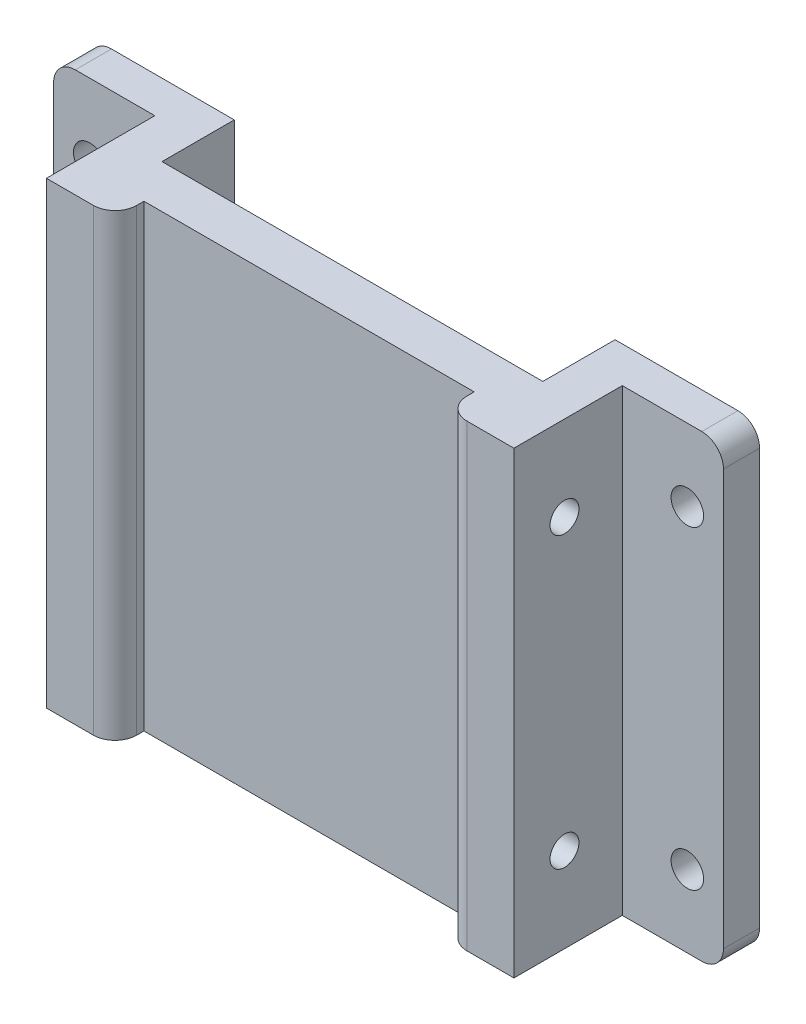
ISO-10303-21;
HEADER;
FILE_DESCRIPTION(('STEP AP214'),'2;1');
FILE_NAME('part.step','',(''),(''),'','','');
FILE_SCHEMA(('AUTOMOTIVE_DESIGN { 1 0 10303 214 1 1 1 1 }'));
ENDSEC;
DATA;
#1=APPLICATION_CONTEXT('core data for automotive mechanical design processes');
#2=APPLICATION_PROTOCOL_DEFINITION('international standard','automotive_design',2000,#1);
#3=PRODUCT_CONTEXT('',#1,'mechanical');
#4=PRODUCT('Part','Part','',(#3));
#5=PRODUCT_RELATED_PRODUCT_CATEGORY('part','',(#4));
#6=PRODUCT_DEFINITION_FORMATION('','',#4);
#7=PRODUCT_DEFINITION_CONTEXT('part definition',#1,'design');
#8=PRODUCT_DEFINITION('design','',#6,#7);
#9=PRODUCT_DEFINITION_SHAPE('','',#8);
#10=(LENGTH_UNIT() NAMED_UNIT(*) SI_UNIT(.MILLI.,.METRE.));
#11=(NAMED_UNIT(*) PLANE_ANGLE_UNIT() SI_UNIT($,.RADIAN.));
#12=(NAMED_UNIT(*) SI_UNIT($,.STERADIAN.) SOLID_ANGLE_UNIT());
#13=UNCERTAINTY_MEASURE_WITH_UNIT(LENGTH_MEASURE(1.E-05),#10,'distance_accuracy_value','');
#14=(GEOMETRIC_REPRESENTATION_CONTEXT(3) GLOBAL_UNCERTAINTY_ASSIGNED_CONTEXT((#13)) GLOBAL_UNIT_ASSIGNED_CONTEXT((#10,
#11,#12)) REPRESENTATION_CONTEXT('',''));
#15=CARTESIAN_POINT('',(0.,0.,0.));
#16=DIRECTION('',(0.,0.,1.));
#17=DIRECTION('',(1.,0.,0.));
#18=AXIS2_PLACEMENT_3D('',#15,#16,#17);
#19=CARTESIAN_POINT('',(-26.35,31.7500000000008,5.));
#20=DIRECTION('',(-1.,0.,0.));
#21=DIRECTION('',(0.,-1.,0.));
#22=AXIS2_PLACEMENT_3D('',#19,#20,#21);
#23=PLANE('',#22);
#24=DIRECTION('',(0.,1.,0.));
#25=VECTOR('',#24,1.);
#26=CARTESIAN_POINT('',(-26.35,-31.7500000000008,10.));
#27=LINE('',#26,#25);
#28=CARTESIAN_POINT('',(-26.35,-31.7500000000008,10.));
#29=VERTEX_POINT('',#28);
#30=CARTESIAN_POINT('',(-26.35,31.7500000000008,10.));
#31=VERTEX_POINT('',#30);
#32=EDGE_CURVE('E210',#29,#31,#27,.T.);
#33=ORIENTED_EDGE('',*,*,#32,.F.);
#34=DIRECTION('',(0.,0.,-1.));
#35=VECTOR('',#34,1.);
#36=CARTESIAN_POINT('',(-26.35,-31.7500000000008,5.));
#37=LINE('',#36,#35);
#38=CARTESIAN_POINT('',(-26.35,-31.7500000000008,0.));
#39=VERTEX_POINT('',#38);
#40=EDGE_CURVE('E260',#29,#39,#37,.T.);
#41=ORIENTED_EDGE('',*,*,#40,.T.);
#42=DIRECTION('',(0.,1.,0.));
#43=VECTOR('',#42,1.);
#44=CARTESIAN_POINT('',(-26.35,31.7500000000008,0.));
#45=LINE('',#44,#43);
#46=CARTESIAN_POINT('',(-26.35,31.7500000000008,0.));
#47=VERTEX_POINT('',#46);
#48=EDGE_CURVE('E254',#39,#47,#45,.T.);
#49=ORIENTED_EDGE('',*,*,#48,.T.);
#50=DIRECTION('',(0.,0.,-1.));
#51=VECTOR('',#50,1.);
#52=CARTESIAN_POINT('',(-26.35,31.7500000000008,5.));
#53=LINE('',#52,#51);
#54=EDGE_CURVE('E250',#31,#47,#53,.T.);
#55=ORIENTED_EDGE('',*,*,#54,.F.);
#56=EDGE_LOOP('',(#33,#41,#49,#55));
#57=FACE_BOUND('',#56,.T.);
#58=ADVANCED_FACE('F33',(#57),#23,.F.);
#59=CARTESIAN_POINT('',(-46.35,31.7500000000008,5.));
#60=DIRECTION('',(1.,0.,0.));
#61=DIRECTION('',(0.,1.,0.));
#62=AXIS2_PLACEMENT_3D('',#59,#60,#61);
#63=PLANE('',#62);
#64=DIRECTION('',(0.,-1.,0.));
#65=VECTOR('',#64,1.);
#66=CARTESIAN_POINT('',(-46.35,31.7500000000008,0.));
#67=LINE('',#66,#65);
#68=CARTESIAN_POINT('',(-46.35,28.7500000000008,0.));
#69=VERTEX_POINT('',#68);
#70=CARTESIAN_POINT('',(-46.35,-28.7500000000008,0.));
#71=VERTEX_POINT('',#70);
#72=EDGE_CURVE('E242',#69,#71,#67,.T.);
#73=ORIENTED_EDGE('',*,*,#72,.T.);
#74=DIRECTION('',(0.,0.,-1.));
#75=VECTOR('',#74,1.);
#76=CARTESIAN_POINT('',(-46.35,-28.7500000000008,5.));
#77=LINE('',#76,#75);
#78=CARTESIAN_POINT('',(-46.35,-28.7500000000008,5.));
#79=VERTEX_POINT('',#78);
#80=EDGE_CURVE('E48',#71,#79,#77,.F.);
#81=ORIENTED_EDGE('',*,*,#80,.T.);
#82=DIRECTION('',(0.,-1.,0.));
#83=VECTOR('',#82,1.);
#84=CARTESIAN_POINT('',(-46.35,31.7500000000008,5.));
#85=LINE('',#84,#83);
#86=CARTESIAN_POINT('',(-46.35,28.7500000000008,5.));
#87=VERTEX_POINT('',#86);
#88=EDGE_CURVE('E243',#87,#79,#85,.T.);
#89=ORIENTED_EDGE('',*,*,#88,.F.);
#90=DIRECTION('',(0.,0.,-1.));
#91=VECTOR('',#90,1.);
#92=CARTESIAN_POINT('',(-46.35,28.7500000000008,5.));
#93=LINE('',#92,#91);
#94=EDGE_CURVE('E307',#87,#69,#93,.T.);
#95=ORIENTED_EDGE('',*,*,#94,.T.);
#96=EDGE_LOOP('',(#73,#81,#89,#95));
#97=FACE_BOUND('',#96,.T.);
#98=ADVANCED_FACE('F312',(#97),#63,.F.);
#99=CARTESIAN_POINT('',(-46.35,-31.7500000000008,5.));
#100=DIRECTION('',(0.,1.,0.));
#101=DIRECTION('',(0.,0.,1.));
#102=AXIS2_PLACEMENT_3D('',#99,#100,#101);
#103=PLANE('',#102);
#104=DIRECTION('',(0.,0.,-1.));
#105=VECTOR('',#104,1.);
#106=CARTESIAN_POINT('',(-22.85,-31.7500000000008,20.));
#107=LINE('',#106,#105);
#108=CARTESIAN_POINT('',(-22.85,-31.7500000000008,17.));
#109=VERTEX_POINT('',#108);
#110=CARTESIAN_POINT('',(-22.8500000000054,-31.7500000000008,16.));
#111=VERTEX_POINT('',#110);
#112=EDGE_CURVE('E478',#109,#111,#107,.T.);
#113=ORIENTED_EDGE('',*,*,#112,.F.);
#114=CARTESIAN_POINT('',(-25.85,-31.7500000000008,17.));
#115=DIRECTION('',(0.,1.,0.));
#116=DIRECTION('',(0.,0.,1.));
#117=AXIS2_PLACEMENT_3D('',#114,#115,#116);
#118=CIRCLE('',#117,3.);
#119=CARTESIAN_POINT('',(-25.85,-31.7500000000008,20.));
#120=VERTEX_POINT('',#119);
#121=EDGE_CURVE('E273',#109,#120,#118,.F.);
#122=ORIENTED_EDGE('',*,*,#121,.T.);
#123=DIRECTION('',(1.,0.,0.));
#124=VECTOR('',#123,1.);
#125=CARTESIAN_POINT('',(-26.35,-31.7500000000008,20.));
#126=LINE('',#125,#124);
#127=CARTESIAN_POINT('',(-32.35,-31.7500000000008,20.));
#128=VERTEX_POINT('',#127);
#129=EDGE_CURVE('E231',#128,#120,#126,.T.);
#130=ORIENTED_EDGE('',*,*,#129,.F.);
#131=DIRECTION('',(0.,0.,-1.));
#132=VECTOR('',#131,1.);
#133=CARTESIAN_POINT('',(-32.35,-31.7500000000008,20.));
#134=LINE('',#133,#132);
#135=CARTESIAN_POINT('',(-32.35,-31.7500000000008,5.));
#136=VERTEX_POINT('',#135);
#137=EDGE_CURVE('E234',#128,#136,#134,.T.);
#138=ORIENTED_EDGE('',*,*,#137,.T.);
#139=DIRECTION('',(1.,0.,0.));
#140=VECTOR('',#139,1.);
#141=CARTESIAN_POINT('',(-46.35,-31.7500000000008,5.));
#142=LINE('',#141,#140);
#143=CARTESIAN_POINT('',(-43.35,-31.7500000000008,5.));
#144=VERTEX_POINT('',#143);
#145=EDGE_CURVE('E245',#144,#136,#142,.T.);
#146=ORIENTED_EDGE('',*,*,#145,.F.);
#147=DIRECTION('',(0.,0.,-1.));
#148=VECTOR('',#147,1.);
#149=CARTESIAN_POINT('',(-43.35,-31.7500000000008,5.));
#150=LINE('',#149,#148);
#151=CARTESIAN_POINT('',(-43.35,-31.7500000000008,0.));
#152=VERTEX_POINT('',#151);
#153=EDGE_CURVE('E266',#144,#152,#150,.T.);
#154=ORIENTED_EDGE('',*,*,#153,.T.);
#155=DIRECTION('',(1.,0.,0.));
#156=VECTOR('',#155,1.);
#157=CARTESIAN_POINT('',(-46.35,-31.7500000000008,0.));
#158=LINE('',#157,#156);
#159=EDGE_CURVE('E252',#152,#39,#158,.T.);
#160=ORIENTED_EDGE('',*,*,#159,.T.);
#161=ORIENTED_EDGE('',*,*,#40,.F.);
#162=DIRECTION('',(-1.,0.,0.));
#163=VECTOR('',#162,1.);
#164=CARTESIAN_POINT('',(500000.,-31.7500000000008,10.));
#165=LINE('',#164,#163);
#166=CARTESIAN_POINT('',(26.3499999999794,-31.7500000000008,10.));
#167=VERTEX_POINT('',#166);
#168=EDGE_CURVE('E213',#167,#29,#165,.T.);
#169=ORIENTED_EDGE('',*,*,#168,.F.);
#170=DIRECTION('',(0.,0.,-1.));
#171=VECTOR('',#170,1.);
#172=CARTESIAN_POINT('',(26.35,-31.7500000000008,5.));
#173=LINE('',#172,#171);
#174=CARTESIAN_POINT('',(26.35,-31.7500000000008,0.));
#175=VERTEX_POINT('',#174);
#176=EDGE_CURVE('E406',#167,#175,#173,.T.);
#177=ORIENTED_EDGE('',*,*,#176,.T.);
#178=DIRECTION('',(1.,0.,0.));
#179=VECTOR('',#178,1.);
#180=CARTESIAN_POINT('',(46.35,-31.7500000000008,0.));
#181=LINE('',#180,#179);
#182=CARTESIAN_POINT('',(43.35,-31.7500000000008,0.));
#183=VERTEX_POINT('',#182);
#184=EDGE_CURVE('E399',#175,#183,#181,.T.);
#185=ORIENTED_EDGE('',*,*,#184,.T.);
#186=DIRECTION('',(0.,0.,-1.));
#187=VECTOR('',#186,1.);
#188=CARTESIAN_POINT('',(43.35,-31.7500000000008,5.));
#189=LINE('',#188,#187);
#190=CARTESIAN_POINT('',(43.35,-31.7500000000008,5.));
#191=VERTEX_POINT('',#190);
#192=EDGE_CURVE('E269',#183,#191,#189,.F.);
#193=ORIENTED_EDGE('',*,*,#192,.T.);
#194=DIRECTION('',(1.,0.,0.));
#195=VECTOR('',#194,1.);
#196=CARTESIAN_POINT('',(46.35,-31.7500000000008,5.));
#197=LINE('',#196,#195);
#198=CARTESIAN_POINT('',(32.35,-31.7500000000008,5.));
#199=VERTEX_POINT('',#198);
#200=EDGE_CURVE('E394',#199,#191,#197,.T.);
#201=ORIENTED_EDGE('',*,*,#200,.F.);
#202=DIRECTION('',(0.,0.,-1.));
#203=VECTOR('',#202,1.);
#204=CARTESIAN_POINT('',(32.35,-31.7500000000008,20.));
#205=LINE('',#204,#203);
#206=CARTESIAN_POINT('',(32.35,-31.7500000000008,20.));
#207=VERTEX_POINT('',#206);
#208=EDGE_CURVE('E402',#207,#199,#205,.T.);
#209=ORIENTED_EDGE('',*,*,#208,.F.);
#210=DIRECTION('',(1.,0.,0.));
#211=VECTOR('',#210,1.);
#212=CARTESIAN_POINT('',(26.35,-31.7500000000008,20.));
#213=LINE('',#212,#211);
#214=CARTESIAN_POINT('',(25.85,-31.7500000000008,20.));
#215=VERTEX_POINT('',#214);
#216=EDGE_CURVE('E487',#215,#207,#213,.T.);
#217=ORIENTED_EDGE('',*,*,#216,.F.);
#218=CARTESIAN_POINT('',(25.85,-31.7500000000008,17.));
#219=DIRECTION('',(0.,1.,0.));
#220=DIRECTION('',(0.,0.,1.));
#221=AXIS2_PLACEMENT_3D('',#218,#219,#220);
#222=CIRCLE('',#221,3.);
#223=CARTESIAN_POINT('',(22.85,-31.7500000000008,17.));
#224=VERTEX_POINT('',#223);
#225=EDGE_CURVE('E271',#215,#224,#222,.F.);
#226=ORIENTED_EDGE('',*,*,#225,.T.);
#227=DIRECTION('',(0.,0.,-1.));
#228=VECTOR('',#227,1.);
#229=CARTESIAN_POINT('',(22.85,-31.7500000000008,20.));
#230=LINE('',#229,#228);
#231=CARTESIAN_POINT('',(22.85,-31.7500000000008,16.));
#232=VERTEX_POINT('',#231);
#233=EDGE_CURVE('E202',#224,#232,#230,.T.);
#234=ORIENTED_EDGE('',*,*,#233,.T.);
#235=DIRECTION('',(-1.,0.,0.));
#236=VECTOR('',#235,1.);
#237=CARTESIAN_POINT('',(500000.,-31.7500000000008,16.));
#238=LINE('',#237,#236);
#239=EDGE_CURVE('E201',#232,#111,#238,.T.);
#240=ORIENTED_EDGE('',*,*,#239,.T.);
#241=EDGE_LOOP('',(#113,#122,#130,#138,#146,#154,#160,#161,#169,#177,#185,#193,#201,#209,#217,
#226,#234,#240));
#242=FACE_BOUND('',#241,.T.);
#243=ADVANCED_FACE('F326',(#242),#103,.F.);
#244=CARTESIAN_POINT('',(-46.35,31.7500000000008,5.));
#245=DIRECTION('',(0.,-1.,0.));
#246=DIRECTION('',(1.,0.,0.));
#247=AXIS2_PLACEMENT_3D('',#244,#245,#246);
#248=PLANE('',#247);
#249=DIRECTION('',(-1.,0.,0.));
#250=VECTOR('',#249,1.);
#251=CARTESIAN_POINT('',(-26.35,31.7500000000008,20.));
#252=LINE('',#251,#250);
#253=CARTESIAN_POINT('',(-25.85,31.7500000000008,20.));
#254=VERTEX_POINT('',#253);
#255=CARTESIAN_POINT('',(-32.35,31.7500000000008,20.));
#256=VERTEX_POINT('',#255);
#257=EDGE_CURVE('E227',#254,#256,#252,.T.);
#258=ORIENTED_EDGE('',*,*,#257,.F.);
#259=CARTESIAN_POINT('',(-25.85,31.7500000000008,17.));
#260=DIRECTION('',(0.,-1.,0.));
#261=DIRECTION('',(1.,0.,0.));
#262=AXIS2_PLACEMENT_3D('',#259,#260,#261);
#263=CIRCLE('',#262,3.);
#264=CARTESIAN_POINT('',(-22.85,31.7500000000008,17.));
#265=VERTEX_POINT('',#264);
#266=EDGE_CURVE('E284',#254,#265,#263,.F.);
#267=ORIENTED_EDGE('',*,*,#266,.T.);
#268=DIRECTION('',(0.,0.,1.));
#269=VECTOR('',#268,1.);
#270=CARTESIAN_POINT('',(-22.85,31.7500000000008,20.));
#271=LINE('',#270,#269);
#272=CARTESIAN_POINT('',(-22.85,31.7500000000008,16.));
#273=VERTEX_POINT('',#272);
#274=EDGE_CURVE('E208',#273,#265,#271,.T.);
#275=ORIENTED_EDGE('',*,*,#274,.F.);
#276=DIRECTION('',(-1.,0.,0.));
#277=VECTOR('',#276,1.);
#278=CARTESIAN_POINT('',(500000.,31.7500000000008,16.));
#279=LINE('',#278,#277);
#280=CARTESIAN_POINT('',(22.85,31.7500000000008,16.));
#281=VERTEX_POINT('',#280);
#282=EDGE_CURVE('E198',#281,#273,#279,.T.);
#283=ORIENTED_EDGE('',*,*,#282,.F.);
#284=DIRECTION('',(0.,0.,1.));
#285=VECTOR('',#284,1.);
#286=CARTESIAN_POINT('',(22.85,31.7500000000008,20.));
#287=LINE('',#286,#285);
#288=CARTESIAN_POINT('',(22.85,31.7500000000008,17.));
#289=VERTEX_POINT('',#288);
#290=EDGE_CURVE('E182',#281,#289,#287,.T.);
#291=ORIENTED_EDGE('',*,*,#290,.T.);
#292=CARTESIAN_POINT('',(25.85,31.7500000000008,17.));
#293=DIRECTION('',(0.,-1.,0.));
#294=DIRECTION('',(1.,0.,0.));
#295=AXIS2_PLACEMENT_3D('',#292,#293,#294);
#296=CIRCLE('',#295,3.);
#297=CARTESIAN_POINT('',(25.85,31.7500000000008,20.));
#298=VERTEX_POINT('',#297);
#299=EDGE_CURVE('E282',#289,#298,#296,.F.);
#300=ORIENTED_EDGE('',*,*,#299,.T.);
#301=DIRECTION('',(-1.,0.,0.));
#302=VECTOR('',#301,1.);
#303=CARTESIAN_POINT('',(26.35,31.7500000000008,20.));
#304=LINE('',#303,#302);
#305=CARTESIAN_POINT('',(32.35,31.7500000000008,20.));
#306=VERTEX_POINT('',#305);
#307=EDGE_CURVE('E484',#306,#298,#304,.T.);
#308=ORIENTED_EDGE('',*,*,#307,.F.);
#309=DIRECTION('',(0.,0.,-1.));
#310=VECTOR('',#309,1.);
#311=CARTESIAN_POINT('',(32.35,31.7500000000008,20.));
#312=LINE('',#311,#310);
#313=CARTESIAN_POINT('',(32.35,31.7500000000008,5.));
#314=VERTEX_POINT('',#313);
#315=EDGE_CURVE('E393',#306,#314,#312,.T.);
#316=ORIENTED_EDGE('',*,*,#315,.T.);
#317=DIRECTION('',(-1.,0.,0.));
#318=VECTOR('',#317,1.);
#319=CARTESIAN_POINT('',(46.35,31.7500000000008,5.));
#320=LINE('',#319,#318);
#321=CARTESIAN_POINT('',(43.35,31.7500000000008,5.));
#322=VERTEX_POINT('',#321);
#323=EDGE_CURVE('E385',#322,#314,#320,.T.);
#324=ORIENTED_EDGE('',*,*,#323,.F.);
#325=DIRECTION('',(0.,0.,-1.));
#326=VECTOR('',#325,1.);
#327=CARTESIAN_POINT('',(43.35,31.7500000000008,5.));
#328=LINE('',#327,#326);
#329=CARTESIAN_POINT('',(43.35,31.7500000000008,0.));
#330=VERTEX_POINT('',#329);
#331=EDGE_CURVE('E279',#322,#330,#328,.T.);
#332=ORIENTED_EDGE('',*,*,#331,.T.);
#333=DIRECTION('',(-1.,0.,0.));
#334=VECTOR('',#333,1.);
#335=CARTESIAN_POINT('',(46.35,31.7500000000008,0.));
#336=LINE('',#335,#334);
#337=CARTESIAN_POINT('',(26.35,31.7500000000008,0.));
#338=VERTEX_POINT('',#337);
#339=EDGE_CURVE('E407',#330,#338,#336,.T.);
#340=ORIENTED_EDGE('',*,*,#339,.T.);
#341=DIRECTION('',(0.,0.,-1.));
#342=VECTOR('',#341,1.);
#343=CARTESIAN_POINT('',(26.35,31.7500000000008,5.));
#344=LINE('',#343,#342);
#345=CARTESIAN_POINT('',(26.35,31.7500000000008,10.));
#346=VERTEX_POINT('',#345);
#347=EDGE_CURVE('E216',#346,#338,#344,.T.);
#348=ORIENTED_EDGE('',*,*,#347,.F.);
#349=DIRECTION('',(-1.,0.,0.));
#350=VECTOR('',#349,1.);
#351=CARTESIAN_POINT('',(500000.,31.7500000000008,10.));
#352=LINE('',#351,#350);
#353=EDGE_CURVE('E209',#346,#31,#352,.T.);
#354=ORIENTED_EDGE('',*,*,#353,.T.);
#355=ORIENTED_EDGE('',*,*,#54,.T.);
#356=DIRECTION('',(-1.,0.,0.));
#357=VECTOR('',#356,1.);
#358=CARTESIAN_POINT('',(-46.35,31.7500000000008,0.));
#359=LINE('',#358,#357);
#360=CARTESIAN_POINT('',(-43.35,31.7500000000008,0.));
#361=VERTEX_POINT('',#360);
#362=EDGE_CURVE('E246',#47,#361,#359,.T.);
#363=ORIENTED_EDGE('',*,*,#362,.T.);
#364=DIRECTION('',(0.,0.,-1.));
#365=VECTOR('',#364,1.);
#366=CARTESIAN_POINT('',(-43.35,31.7500000000008,5.));
#367=LINE('',#366,#365);
#368=CARTESIAN_POINT('',(-43.35,31.7500000000008,5.));
#369=VERTEX_POINT('',#368);
#370=EDGE_CURVE('E277',#361,#369,#367,.F.);
#371=ORIENTED_EDGE('',*,*,#370,.T.);
#372=DIRECTION('',(-1.,0.,0.));
#373=VECTOR('',#372,1.);
#374=CARTESIAN_POINT('',(-46.35,31.7500000000008,5.));
#375=LINE('',#374,#373);
#376=CARTESIAN_POINT('',(-32.35,31.7500000000008,5.));
#377=VERTEX_POINT('',#376);
#378=EDGE_CURVE('E248',#377,#369,#375,.T.);
#379=ORIENTED_EDGE('',*,*,#378,.F.);
#380=DIRECTION('',(0.,0.,-1.));
#381=VECTOR('',#380,1.);
#382=CARTESIAN_POINT('',(-32.35,31.7500000000008,20.));
#383=LINE('',#382,#381);
#384=EDGE_CURVE('E239',#256,#377,#383,.T.);
#385=ORIENTED_EDGE('',*,*,#384,.F.);
#386=EDGE_LOOP('',(#258,#267,#275,#283,#291,#300,#308,#316,#324,#332,#340,#348,#354,#355,#363,
#371,#379,#385));
#387=FACE_BOUND('',#386,.T.);
#388=ADVANCED_FACE('F206',(#387),#248,.F.);
#389=CARTESIAN_POINT('',(0.,0.,5.));
#390=DIRECTION('',(0.,0.,1.));
#391=DIRECTION('',(1.,0.,0.));
#392=AXIS2_PLACEMENT_3D('',#389,#390,#391);
#393=PLANE('',#392);
#394=CARTESIAN_POINT('',(-41.35,-21.7500000000008,5.));
#395=DIRECTION('',(0.,0.,1.));
#396=DIRECTION('',(1.,0.,0.));
#397=AXIS2_PLACEMENT_3D('',#394,#395,#396);
#398=CIRCLE('',#397,2.25);
#399=CARTESIAN_POINT('',(-39.1,-21.7500000000008,5.));
#400=VERTEX_POINT('',#399);
#401=EDGE_CURVE('E471',#400,#400,#398,.T.);
#402=ORIENTED_EDGE('',*,*,#401,.F.);
#403=EDGE_LOOP('',(#402));
#404=FACE_BOUND('',#403,.T.);
#405=CARTESIAN_POINT('',(-41.35,21.7500000000008,5.));
#406=DIRECTION('',(0.,0.,1.));
#407=DIRECTION('',(1.,0.,0.));
#408=AXIS2_PLACEMENT_3D('',#405,#406,#407);
#409=CIRCLE('',#408,2.25);
#410=CARTESIAN_POINT('',(-39.1,21.7500000000008,5.));
#411=VERTEX_POINT('',#410);
#412=EDGE_CURVE('E468',#411,#411,#409,.T.);
#413=ORIENTED_EDGE('',*,*,#412,.F.);
#414=EDGE_LOOP('',(#413));
#415=FACE_BOUND('',#414,.T.);
#416=ORIENTED_EDGE('',*,*,#88,.T.);
#417=CARTESIAN_POINT('',(-43.35,-28.7500000000008,5.));
#418=DIRECTION('',(0.,0.,1.));
#419=DIRECTION('',(1.,0.,0.));
#420=AXIS2_PLACEMENT_3D('',#417,#418,#419);
#421=CIRCLE('',#420,3.);
#422=EDGE_CURVE('E11',#79,#144,#421,.T.);
#423=ORIENTED_EDGE('',*,*,#422,.T.);
#424=ORIENTED_EDGE('',*,*,#145,.T.);
#425=DIRECTION('',(0.,-1.,0.));
#426=VECTOR('',#425,1.);
#427=CARTESIAN_POINT('',(-32.35,31.7500000000008,5.));
#428=LINE('',#427,#426);
#429=EDGE_CURVE('E226',#377,#136,#428,.T.);
#430=ORIENTED_EDGE('',*,*,#429,.F.);
#431=ORIENTED_EDGE('',*,*,#378,.T.);
#432=CARTESIAN_POINT('',(-43.35,28.7500000000008,5.));
#433=DIRECTION('',(0.,0.,1.));
#434=DIRECTION('',(1.,0.,0.));
#435=AXIS2_PLACEMENT_3D('',#432,#433,#434);
#436=CIRCLE('',#435,3.);
#437=EDGE_CURVE('E41',#369,#87,#436,.T.);
#438=ORIENTED_EDGE('',*,*,#437,.T.);
#439=EDGE_LOOP('',(#416,#423,#424,#430,#431,#438));
#440=FACE_BOUND('',#439,.T.);
#441=ADVANCED_FACE('F330',(#404,#415,#440),#393,.T.);
#442=CARTESIAN_POINT('',(0.,0.,0.));
#443=DIRECTION('',(0.,0.,1.));
#444=DIRECTION('',(1.,0.,0.));
#445=AXIS2_PLACEMENT_3D('',#442,#443,#444);
#446=PLANE('',#445);
#447=CARTESIAN_POINT('',(-41.35,-21.7500000000008,0.));
#448=DIRECTION('',(0.,0.,1.));
#449=DIRECTION('',(1.,0.,0.));
#450=AXIS2_PLACEMENT_3D('',#447,#448,#449);
#451=CIRCLE('',#450,2.25);
#452=CARTESIAN_POINT('',(-39.1,-21.7500000000008,0.));
#453=VERTEX_POINT('',#452);
#454=EDGE_CURVE('E464',#453,#453,#451,.T.);
#455=ORIENTED_EDGE('',*,*,#454,.T.);
#456=EDGE_LOOP('',(#455));
#457=FACE_BOUND('',#456,.T.);
#458=CARTESIAN_POINT('',(-41.35,21.7500000000008,0.));
#459=DIRECTION('',(0.,0.,1.));
#460=DIRECTION('',(1.,0.,0.));
#461=AXIS2_PLACEMENT_3D('',#458,#459,#460);
#462=CIRCLE('',#461,2.25);
#463=CARTESIAN_POINT('',(-39.1,21.7500000000008,0.));
#464=VERTEX_POINT('',#463);
#465=EDGE_CURVE('E193',#464,#464,#462,.T.);
#466=ORIENTED_EDGE('',*,*,#465,.T.);
#467=EDGE_LOOP('',(#466));
#468=FACE_BOUND('',#467,.T.);
#469=ORIENTED_EDGE('',*,*,#159,.F.);
#470=CARTESIAN_POINT('',(-43.35,-28.7500000000008,0.));
#471=DIRECTION('',(0.,0.,1.));
#472=DIRECTION('',(1.,0.,0.));
#473=AXIS2_PLACEMENT_3D('',#470,#471,#472);
#474=CIRCLE('',#473,3.);
#475=EDGE_CURVE('E305',#152,#71,#474,.F.);
#476=ORIENTED_EDGE('',*,*,#475,.T.);
#477=ORIENTED_EDGE('',*,*,#72,.F.);
#478=CARTESIAN_POINT('',(-43.35,28.7500000000008,0.));
#479=DIRECTION('',(0.,0.,1.));
#480=DIRECTION('',(1.,0.,0.));
#481=AXIS2_PLACEMENT_3D('',#478,#479,#480);
#482=CIRCLE('',#481,3.);
#483=EDGE_CURVE('E303',#69,#361,#482,.F.);
#484=ORIENTED_EDGE('',*,*,#483,.T.);
#485=ORIENTED_EDGE('',*,*,#362,.F.);
#486=ORIENTED_EDGE('',*,*,#48,.F.);
#487=EDGE_LOOP('',(#469,#476,#477,#484,#485,#486));
#488=FACE_BOUND('',#487,.T.);
#489=ADVANCED_FACE('F316',(#457,#468,#488),#446,.F.);
#490=CARTESIAN_POINT('',(-32.35,31.7500000000008,20.));
#491=DIRECTION('',(1.,0.,0.));
#492=DIRECTION('',(0.,1.,0.));
#493=AXIS2_PLACEMENT_3D('',#490,#491,#492);
#494=PLANE('',#493);
#495=CARTESIAN_POINT('',(-32.35,20.,13.));
#496=DIRECTION('',(-1.,0.,0.));
#497=DIRECTION('',(0.,-1.,0.));
#498=AXIS2_PLACEMENT_3D('',#495,#496,#497);
#499=CIRCLE('',#498,2.);
#500=CARTESIAN_POINT('',(-32.35,18.,13.));
#501=VERTEX_POINT('',#500);
#502=EDGE_CURVE('E577',#501,#501,#499,.T.);
#503=ORIENTED_EDGE('',*,*,#502,.F.);
#504=EDGE_LOOP('',(#503));
#505=FACE_BOUND('',#504,.T.);
#506=CARTESIAN_POINT('',(-32.35,-20.,13.));
#507=DIRECTION('',(-1.,0.,0.));
#508=DIRECTION('',(0.,-1.,0.));
#509=AXIS2_PLACEMENT_3D('',#506,#507,#508);
#510=CIRCLE('',#509,2.);
#511=CARTESIAN_POINT('',(-32.35,-22.,13.));
#512=VERTEX_POINT('',#511);
#513=EDGE_CURVE('E563',#512,#512,#510,.T.);
#514=ORIENTED_EDGE('',*,*,#513,.F.);
#515=EDGE_LOOP('',(#514));
#516=FACE_BOUND('',#515,.T.);
#517=ORIENTED_EDGE('',*,*,#429,.T.);
#518=ORIENTED_EDGE('',*,*,#137,.F.);
#519=DIRECTION('',(0.,-1.,0.));
#520=VECTOR('',#519,1.);
#521=CARTESIAN_POINT('',(-32.35,31.7500000000008,20.));
#522=LINE('',#521,#520);
#523=EDGE_CURVE('E229',#256,#128,#522,.T.);
#524=ORIENTED_EDGE('',*,*,#523,.F.);
#525=ORIENTED_EDGE('',*,*,#384,.T.);
#526=EDGE_LOOP('',(#517,#518,#524,#525));
#527=FACE_BOUND('',#526,.T.);
#528=ADVANCED_FACE('F333',(#505,#516,#527),#494,.F.);
#529=CARTESIAN_POINT('',(0.,0.,20.));
#530=DIRECTION('',(0.,0.,-1.));
#531=DIRECTION('',(-1.,0.,0.));
#532=AXIS2_PLACEMENT_3D('',#529,#530,#531);
#533=PLANE('',#532);
#534=ORIENTED_EDGE('',*,*,#129,.T.);
#535=DIRECTION('',(0.,-1.,0.));
#536=VECTOR('',#535,1.);
#537=CARTESIAN_POINT('',(-25.85,31.7500000000008,20.));
#538=LINE('',#537,#536);
#539=EDGE_CURVE('E275',#120,#254,#538,.F.);
#540=ORIENTED_EDGE('',*,*,#539,.T.);
#541=ORIENTED_EDGE('',*,*,#257,.T.);
#542=ORIENTED_EDGE('',*,*,#523,.T.);
#543=EDGE_LOOP('',(#534,#540,#541,#542));
#544=FACE_BOUND('',#543,.T.);
#545=ADVANCED_FACE('F445',(#544),#533,.F.);
#546=CARTESIAN_POINT('',(500000.,-31.7500000000008,10.));
#547=DIRECTION('',(0.,0.,1.));
#548=DIRECTION('',(1.,0.,0.));
#549=AXIS2_PLACEMENT_3D('',#546,#547,#548);
#550=PLANE('',#549);
#551=DIRECTION('',(0.,1.,0.));
#552=VECTOR('',#551,1.);
#553=CARTESIAN_POINT('',(26.3499999999794,-31.7499999999462,10.));
#554=LINE('',#553,#552);
#555=EDGE_CURVE('E223',#167,#346,#554,.T.);
#556=ORIENTED_EDGE('',*,*,#555,.F.);
#557=ORIENTED_EDGE('',*,*,#168,.T.);
#558=ORIENTED_EDGE('',*,*,#32,.T.);
#559=ORIENTED_EDGE('',*,*,#353,.F.);
#560=EDGE_LOOP('',(#556,#557,#558,#559));
#561=FACE_BOUND('',#560,.T.);
#562=ADVANCED_FACE('F440',(#561),#550,.F.);
#563=CARTESIAN_POINT('',(500000.,-31.7500000000008,16.));
#564=DIRECTION('',(0.,0.,-1.));
#565=DIRECTION('',(-1.,0.,0.));
#566=AXIS2_PLACEMENT_3D('',#563,#564,#565);
#567=PLANE('',#566);
#568=ORIENTED_EDGE('',*,*,#239,.F.);
#569=DIRECTION('',(0.,1.,0.));
#570=VECTOR('',#569,1.);
#571=CARTESIAN_POINT('',(22.85,31.7500000000008,16.));
#572=LINE('',#571,#570);
#573=EDGE_CURVE('E186',#232,#281,#572,.T.);
#574=ORIENTED_EDGE('',*,*,#573,.T.);
#575=ORIENTED_EDGE('',*,*,#282,.T.);
#576=DIRECTION('',(0.,1.,0.));
#577=VECTOR('',#576,1.);
#578=CARTESIAN_POINT('',(-22.85,31.7500000000008,16.));
#579=LINE('',#578,#577);
#580=EDGE_CURVE('E480',#111,#273,#579,.T.);
#581=ORIENTED_EDGE('',*,*,#580,.F.);
#582=EDGE_LOOP('',(#568,#574,#575,#581));
#583=FACE_BOUND('',#582,.T.);
#584=ADVANCED_FACE('F196',(#583),#567,.F.);
#585=CARTESIAN_POINT('',(26.35,31.7500000000008,5.));
#586=DIRECTION('',(1.,0.,0.));
#587=DIRECTION('',(0.,1.,0.));
#588=AXIS2_PLACEMENT_3D('',#585,#586,#587);
#589=PLANE('',#588);
#590=ORIENTED_EDGE('',*,*,#176,.F.);
#591=ORIENTED_EDGE('',*,*,#555,.T.);
#592=ORIENTED_EDGE('',*,*,#347,.T.);
#593=DIRECTION('',(0.,-1.,0.));
#594=VECTOR('',#593,1.);
#595=CARTESIAN_POINT('',(26.35,31.7500000000008,0.));
#596=LINE('',#595,#594);
#597=EDGE_CURVE('E409',#338,#175,#596,.T.);
#598=ORIENTED_EDGE('',*,*,#597,.T.);
#599=EDGE_LOOP('',(#590,#591,#592,#598));
#600=FACE_BOUND('',#599,.T.);
#601=ADVANCED_FACE('F419',(#600),#589,.F.);
#602=CARTESIAN_POINT('',(46.35,31.7500000000008,5.));
#603=DIRECTION('',(-1.,0.,0.));
#604=DIRECTION('',(0.,-1.,0.));
#605=AXIS2_PLACEMENT_3D('',#602,#603,#604);
#606=PLANE('',#605);
#607=DIRECTION('',(0.,1.,0.));
#608=VECTOR('',#607,1.);
#609=CARTESIAN_POINT('',(46.35,31.7500000000008,5.));
#610=LINE('',#609,#608);
#611=CARTESIAN_POINT('',(46.35,-28.7500000000008,5.));
#612=VERTEX_POINT('',#611);
#613=CARTESIAN_POINT('',(46.35,28.7500000000008,5.));
#614=VERTEX_POINT('',#613);
#615=EDGE_CURVE('E388',#612,#614,#610,.T.);
#616=ORIENTED_EDGE('',*,*,#615,.F.);
#617=DIRECTION('',(0.,0.,-1.));
#618=VECTOR('',#617,1.);
#619=CARTESIAN_POINT('',(46.35,-28.7500000000008,5.));
#620=LINE('',#619,#618);
#621=CARTESIAN_POINT('',(46.35,-28.7500000000008,0.));
#622=VERTEX_POINT('',#621);
#623=EDGE_CURVE('E292',#612,#622,#620,.T.);
#624=ORIENTED_EDGE('',*,*,#623,.T.);
#625=DIRECTION('',(0.,1.,0.));
#626=VECTOR('',#625,1.);
#627=CARTESIAN_POINT('',(46.35,31.7500000000008,0.));
#628=LINE('',#627,#626);
#629=CARTESIAN_POINT('',(46.35,28.7500000000008,0.));
#630=VERTEX_POINT('',#629);
#631=EDGE_CURVE('E395',#622,#630,#628,.T.);
#632=ORIENTED_EDGE('',*,*,#631,.T.);
#633=DIRECTION('',(0.,0.,-1.));
#634=VECTOR('',#633,1.);
#635=CARTESIAN_POINT('',(46.35,28.7500000000008,5.));
#636=LINE('',#635,#634);
#637=EDGE_CURVE('E290',#630,#614,#636,.F.);
#638=ORIENTED_EDGE('',*,*,#637,.T.);
#639=EDGE_LOOP('',(#616,#624,#632,#638));
#640=FACE_BOUND('',#639,.T.);
#641=ADVANCED_FACE('F430',(#640),#606,.F.);
#642=CARTESIAN_POINT('',(0.,0.,5.));
#643=DIRECTION('',(0.,0.,1.));
#644=DIRECTION('',(1.,0.,0.));
#645=AXIS2_PLACEMENT_3D('',#642,#643,#644);
#646=PLANE('',#645);
#647=CARTESIAN_POINT('',(41.35,21.7500000000008,5.));
#648=DIRECTION('',(0.,0.,-1.));
#649=DIRECTION('',(-1.,0.,0.));
#650=AXIS2_PLACEMENT_3D('',#647,#648,#649);
#651=CIRCLE('',#650,2.25);
#652=CARTESIAN_POINT('',(39.1,21.7500000000008,5.));
#653=VERTEX_POINT('',#652);
#654=EDGE_CURVE('E590',#653,#653,#651,.T.);
#655=ORIENTED_EDGE('',*,*,#654,.T.);
#656=EDGE_LOOP('',(#655));
#657=FACE_BOUND('',#656,.T.);
#658=CARTESIAN_POINT('',(41.35,-21.7500000000008,5.));
#659=DIRECTION('',(0.,0.,-1.));
#660=DIRECTION('',(-1.,0.,0.));
#661=AXIS2_PLACEMENT_3D('',#658,#659,#660);
#662=CIRCLE('',#661,2.25);
#663=CARTESIAN_POINT('',(39.1,-21.7500000000008,5.));
#664=VERTEX_POINT('',#663);
#665=EDGE_CURVE('E585',#664,#664,#662,.T.);
#666=ORIENTED_EDGE('',*,*,#665,.T.);
#667=EDGE_LOOP('',(#666));
#668=FACE_BOUND('',#667,.T.);
#669=ORIENTED_EDGE('',*,*,#200,.T.);
#670=CARTESIAN_POINT('',(43.35,-28.7500000000008,5.));
#671=DIRECTION('',(0.,0.,1.));
#672=DIRECTION('',(1.,0.,0.));
#673=AXIS2_PLACEMENT_3D('',#670,#671,#672);
#674=CIRCLE('',#673,3.);
#675=EDGE_CURVE('E301',#191,#612,#674,.T.);
#676=ORIENTED_EDGE('',*,*,#675,.T.);
#677=ORIENTED_EDGE('',*,*,#615,.T.);
#678=CARTESIAN_POINT('',(43.35,28.7500000000008,5.));
#679=DIRECTION('',(0.,0.,1.));
#680=DIRECTION('',(1.,0.,0.));
#681=AXIS2_PLACEMENT_3D('',#678,#679,#680);
#682=CIRCLE('',#681,3.);
#683=EDGE_CURVE('E299',#614,#322,#682,.T.);
#684=ORIENTED_EDGE('',*,*,#683,.T.);
#685=ORIENTED_EDGE('',*,*,#323,.T.);
#686=DIRECTION('',(0.,1.,0.));
#687=VECTOR('',#686,1.);
#688=CARTESIAN_POINT('',(32.35,31.7500000000008,5.));
#689=LINE('',#688,#687);
#690=EDGE_CURVE('E483',#199,#314,#689,.T.);
#691=ORIENTED_EDGE('',*,*,#690,.F.);
#692=EDGE_LOOP('',(#669,#676,#677,#684,#685,#691));
#693=FACE_BOUND('',#692,.T.);
#694=ADVANCED_FACE('F384',(#657,#668,#693),#646,.T.);
#695=CARTESIAN_POINT('',(0.,0.,0.));
#696=DIRECTION('',(0.,0.,1.));
#697=DIRECTION('',(1.,0.,0.));
#698=AXIS2_PLACEMENT_3D('',#695,#696,#697);
#699=PLANE('',#698);
#700=CARTESIAN_POINT('',(41.35,21.7500000000008,0.));
#701=DIRECTION('',(0.,0.,-1.));
#702=DIRECTION('',(-1.,0.,0.));
#703=AXIS2_PLACEMENT_3D('',#700,#701,#702);
#704=CIRCLE('',#703,2.25);
#705=CARTESIAN_POINT('',(39.1,21.7500000000008,0.));
#706=VERTEX_POINT('',#705);
#707=EDGE_CURVE('E474',#706,#706,#704,.T.);
#708=ORIENTED_EDGE('',*,*,#707,.F.);
#709=EDGE_LOOP('',(#708));
#710=FACE_BOUND('',#709,.T.);
#711=CARTESIAN_POINT('',(41.35,-21.7500000000008,0.));
#712=DIRECTION('',(0.,0.,-1.));
#713=DIRECTION('',(-1.,0.,0.));
#714=AXIS2_PLACEMENT_3D('',#711,#712,#713);
#715=CIRCLE('',#714,2.25);
#716=CARTESIAN_POINT('',(39.1,-21.7500000000008,0.));
#717=VERTEX_POINT('',#716);
#718=EDGE_CURVE('E588',#717,#717,#715,.T.);
#719=ORIENTED_EDGE('',*,*,#718,.F.);
#720=EDGE_LOOP('',(#719));
#721=FACE_BOUND('',#720,.T.);
#722=ORIENTED_EDGE('',*,*,#631,.F.);
#723=CARTESIAN_POINT('',(43.35,-28.7500000000008,0.));
#724=DIRECTION('',(0.,0.,1.));
#725=DIRECTION('',(1.,0.,0.));
#726=AXIS2_PLACEMENT_3D('',#723,#724,#725);
#727=CIRCLE('',#726,3.);
#728=EDGE_CURVE('E297',#622,#183,#727,.F.);
#729=ORIENTED_EDGE('',*,*,#728,.T.);
#730=ORIENTED_EDGE('',*,*,#184,.F.);
#731=ORIENTED_EDGE('',*,*,#597,.F.);
#732=ORIENTED_EDGE('',*,*,#339,.F.);
#733=CARTESIAN_POINT('',(43.35,28.7500000000008,0.));
#734=DIRECTION('',(0.,0.,1.));
#735=DIRECTION('',(1.,0.,0.));
#736=AXIS2_PLACEMENT_3D('',#733,#734,#735);
#737=CIRCLE('',#736,3.);
#738=EDGE_CURVE('E295',#330,#630,#737,.F.);
#739=ORIENTED_EDGE('',*,*,#738,.T.);
#740=EDGE_LOOP('',(#722,#729,#730,#731,#732,#739));
#741=FACE_BOUND('',#740,.T.);
#742=ADVANCED_FACE('F423',(#710,#721,#741),#699,.F.);
#743=CARTESIAN_POINT('',(32.35,31.7500000000008,20.));
#744=DIRECTION('',(-1.,0.,0.));
#745=DIRECTION('',(0.,-1.,0.));
#746=AXIS2_PLACEMENT_3D('',#743,#744,#745);
#747=PLANE('',#746);
#748=CARTESIAN_POINT('',(32.35,20.,13.));
#749=DIRECTION('',(-1.,0.,0.));
#750=DIRECTION('',(0.,-1.,0.));
#751=AXIS2_PLACEMENT_3D('',#748,#749,#750);
#752=CIRCLE('',#751,2.);
#753=CARTESIAN_POINT('',(32.35,18.,13.));
#754=VERTEX_POINT('',#753);
#755=EDGE_CURVE('E560',#754,#754,#752,.T.);
#756=ORIENTED_EDGE('',*,*,#755,.T.);
#757=EDGE_LOOP('',(#756));
#758=FACE_BOUND('',#757,.T.);
#759=CARTESIAN_POINT('',(32.35,-20.,13.));
#760=DIRECTION('',(-1.,0.,0.));
#761=DIRECTION('',(0.,-1.,0.));
#762=AXIS2_PLACEMENT_3D('',#759,#760,#761);
#763=CIRCLE('',#762,2.);
#764=CARTESIAN_POINT('',(32.35,-22.,13.));
#765=VERTEX_POINT('',#764);
#766=EDGE_CURVE('E571',#765,#765,#763,.T.);
#767=ORIENTED_EDGE('',*,*,#766,.T.);
#768=EDGE_LOOP('',(#767));
#769=FACE_BOUND('',#768,.T.);
#770=ORIENTED_EDGE('',*,*,#690,.T.);
#771=ORIENTED_EDGE('',*,*,#315,.F.);
#772=DIRECTION('',(0.,1.,0.));
#773=VECTOR('',#772,1.);
#774=CARTESIAN_POINT('',(32.35,31.7500000000008,20.));
#775=LINE('',#774,#773);
#776=EDGE_CURVE('E489',#207,#306,#775,.T.);
#777=ORIENTED_EDGE('',*,*,#776,.F.);
#778=ORIENTED_EDGE('',*,*,#208,.T.);
#779=EDGE_LOOP('',(#770,#771,#777,#778));
#780=FACE_BOUND('',#779,.T.);
#781=ADVANCED_FACE('F495',(#758,#769,#780),#747,.F.);
#782=CARTESIAN_POINT('',(0.,0.,20.));
#783=DIRECTION('',(0.,0.,-1.));
#784=DIRECTION('',(-1.,0.,0.));
#785=AXIS2_PLACEMENT_3D('',#782,#783,#784);
#786=PLANE('',#785);
#787=ORIENTED_EDGE('',*,*,#307,.T.);
#788=DIRECTION('',(0.,-1.,0.));
#789=VECTOR('',#788,1.);
#790=CARTESIAN_POINT('',(25.85,-31.7500000000008,20.));
#791=LINE('',#790,#789);
#792=EDGE_CURVE('E286',#298,#215,#791,.T.);
#793=ORIENTED_EDGE('',*,*,#792,.T.);
#794=ORIENTED_EDGE('',*,*,#216,.T.);
#795=ORIENTED_EDGE('',*,*,#776,.T.);
#796=EDGE_LOOP('',(#787,#793,#794,#795));
#797=FACE_BOUND('',#796,.T.);
#798=ADVANCED_FACE('F498',(#797),#786,.F.);
#799=CARTESIAN_POINT('',(-22.85,0.,0.));
#800=DIRECTION('',(1.,0.,0.));
#801=DIRECTION('',(0.,0.,-1.));
#802=AXIS2_PLACEMENT_3D('',#799,#800,#801);
#803=PLANE('',#802);
#804=ORIENTED_EDGE('',*,*,#274,.T.);
#805=DIRECTION('',(0.,-1.,0.));
#806=VECTOR('',#805,1.);
#807=CARTESIAN_POINT('',(-22.85,-31.7500000000008,17.));
#808=LINE('',#807,#806);
#809=EDGE_CURVE('E263',#265,#109,#808,.T.);
#810=ORIENTED_EDGE('',*,*,#809,.T.);
#811=ORIENTED_EDGE('',*,*,#112,.T.);
#812=ORIENTED_EDGE('',*,*,#580,.T.);
#813=EDGE_LOOP('',(#804,#810,#811,#812));
#814=FACE_BOUND('',#813,.T.);
#815=ADVANCED_FACE('F501',(#814),#803,.T.);
#816=CARTESIAN_POINT('',(22.85,0.,0.));
#817=DIRECTION('',(-1.,0.,0.));
#818=DIRECTION('',(0.,0.,-1.));
#819=AXIS2_PLACEMENT_3D('',#816,#817,#818);
#820=PLANE('',#819);
#821=ORIENTED_EDGE('',*,*,#233,.F.);
#822=DIRECTION('',(0.,-1.,0.));
#823=VECTOR('',#822,1.);
#824=CARTESIAN_POINT('',(22.85,31.7500000000008,17.));
#825=LINE('',#824,#823);
#826=EDGE_CURVE('E189',#224,#289,#825,.F.);
#827=ORIENTED_EDGE('',*,*,#826,.T.);
#828=ORIENTED_EDGE('',*,*,#290,.F.);
#829=ORIENTED_EDGE('',*,*,#573,.F.);
#830=EDGE_LOOP('',(#821,#827,#828,#829));
#831=FACE_BOUND('',#830,.T.);
#832=ADVANCED_FACE('F185',(#831),#820,.T.);
#833=CARTESIAN_POINT('',(41.35,-21.7500000000008,0.));
#834=DIRECTION('',(0.,0.,1.));
#835=DIRECTION('',(1.,0.,0.));
#836=AXIS2_PLACEMENT_3D('',#833,#834,#835);
#837=CYLINDRICAL_SURFACE('',#836,2.25);
#838=ORIENTED_EDGE('',*,*,#718,.T.);
#839=EDGE_LOOP('',(#838));
#840=FACE_BOUND('',#839,.T.);
#841=ORIENTED_EDGE('',*,*,#665,.F.);
#842=EDGE_LOOP('',(#841));
#843=FACE_BOUND('',#842,.T.);
#844=ADVANCED_FACE('F514',(#840,#843),#837,.F.);
#845=CARTESIAN_POINT('',(41.35,21.7500000000008,0.));
#846=DIRECTION('',(0.,0.,1.));
#847=DIRECTION('',(1.,0.,0.));
#848=AXIS2_PLACEMENT_3D('',#845,#846,#847);
#849=CYLINDRICAL_SURFACE('',#848,2.25);
#850=ORIENTED_EDGE('',*,*,#707,.T.);
#851=EDGE_LOOP('',(#850));
#852=FACE_BOUND('',#851,.T.);
#853=ORIENTED_EDGE('',*,*,#654,.F.);
#854=EDGE_LOOP('',(#853));
#855=FACE_BOUND('',#854,.T.);
#856=ADVANCED_FACE('F518',(#852,#855),#849,.F.);
#857=CARTESIAN_POINT('',(-41.35,21.7500000000008,0.));
#858=DIRECTION('',(0.,0.,1.));
#859=DIRECTION('',(1.,0.,0.));
#860=AXIS2_PLACEMENT_3D('',#857,#858,#859);
#861=CYLINDRICAL_SURFACE('',#860,2.25);
#862=ORIENTED_EDGE('',*,*,#465,.F.);
#863=EDGE_LOOP('',(#862));
#864=FACE_BOUND('',#863,.T.);
#865=ORIENTED_EDGE('',*,*,#412,.T.);
#866=EDGE_LOOP('',(#865));
#867=FACE_BOUND('',#866,.T.);
#868=ADVANCED_FACE('F515',(#864,#867),#861,.F.);
#869=CARTESIAN_POINT('',(-41.35,-21.7500000000008,0.));
#870=DIRECTION('',(0.,0.,1.));
#871=DIRECTION('',(1.,0.,0.));
#872=AXIS2_PLACEMENT_3D('',#869,#870,#871);
#873=CYLINDRICAL_SURFACE('',#872,2.25);
#874=ORIENTED_EDGE('',*,*,#454,.F.);
#875=EDGE_LOOP('',(#874));
#876=FACE_BOUND('',#875,.T.);
#877=ORIENTED_EDGE('',*,*,#401,.T.);
#878=EDGE_LOOP('',(#877));
#879=FACE_BOUND('',#878,.T.);
#880=ADVANCED_FACE('F364',(#876,#879),#873,.F.);
#881=CARTESIAN_POINT('',(-25.85,0.,17.));
#882=DIRECTION('',(0.,1.,0.));
#883=DIRECTION('',(0.,0.,1.));
#884=AXIS2_PLACEMENT_3D('',#881,#882,#883);
#885=CYLINDRICAL_SURFACE('',#884,3.);
#886=ORIENTED_EDGE('',*,*,#266,.F.);
#887=ORIENTED_EDGE('',*,*,#539,.F.);
#888=ORIENTED_EDGE('',*,*,#121,.F.);
#889=ORIENTED_EDGE('',*,*,#809,.F.);
#890=EDGE_LOOP('',(#886,#887,#888,#889));
#891=FACE_BOUND('',#890,.T.);
#892=ADVANCED_FACE('F360',(#891),#885,.T.);
#893=CARTESIAN_POINT('',(25.85,0.,17.));
#894=DIRECTION('',(0.,1.,0.));
#895=DIRECTION('',(0.,0.,1.));
#896=AXIS2_PLACEMENT_3D('',#893,#894,#895);
#897=CYLINDRICAL_SURFACE('',#896,3.);
#898=ORIENTED_EDGE('',*,*,#299,.F.);
#899=ORIENTED_EDGE('',*,*,#826,.F.);
#900=ORIENTED_EDGE('',*,*,#225,.F.);
#901=ORIENTED_EDGE('',*,*,#792,.F.);
#902=EDGE_LOOP('',(#898,#899,#900,#901));
#903=FACE_BOUND('',#902,.T.);
#904=ADVANCED_FACE('F363',(#903),#897,.T.);
#905=CARTESIAN_POINT('',(43.35,-28.7500000000008,5.));
#906=DIRECTION('',(0.,0.,-1.));
#907=DIRECTION('',(-1.,0.,0.));
#908=AXIS2_PLACEMENT_3D('',#905,#906,#907);
#909=CYLINDRICAL_SURFACE('',#908,3.);
#910=ORIENTED_EDGE('',*,*,#675,.F.);
#911=ORIENTED_EDGE('',*,*,#192,.F.);
#912=ORIENTED_EDGE('',*,*,#728,.F.);
#913=ORIENTED_EDGE('',*,*,#623,.F.);
#914=EDGE_LOOP('',(#910,#911,#912,#913));
#915=FACE_BOUND('',#914,.T.);
#916=ADVANCED_FACE('F368',(#915),#909,.T.);
#917=CARTESIAN_POINT('',(43.35,28.7500000000008,5.));
#918=DIRECTION('',(0.,0.,-1.));
#919=DIRECTION('',(-1.,0.,0.));
#920=AXIS2_PLACEMENT_3D('',#917,#918,#919);
#921=CYLINDRICAL_SURFACE('',#920,3.);
#922=ORIENTED_EDGE('',*,*,#683,.F.);
#923=ORIENTED_EDGE('',*,*,#637,.F.);
#924=ORIENTED_EDGE('',*,*,#738,.F.);
#925=ORIENTED_EDGE('',*,*,#331,.F.);
#926=EDGE_LOOP('',(#922,#923,#924,#925));
#927=FACE_BOUND('',#926,.T.);
#928=ADVANCED_FACE('F347',(#927),#921,.T.);
#929=CARTESIAN_POINT('',(-43.35,-28.7500000000008,5.));
#930=DIRECTION('',(0.,0.,-1.));
#931=DIRECTION('',(-1.,0.,0.));
#932=AXIS2_PLACEMENT_3D('',#929,#930,#931);
#933=CYLINDRICAL_SURFACE('',#932,3.);
#934=ORIENTED_EDGE('',*,*,#422,.F.);
#935=ORIENTED_EDGE('',*,*,#80,.F.);
#936=ORIENTED_EDGE('',*,*,#475,.F.);
#937=ORIENTED_EDGE('',*,*,#153,.F.);
#938=EDGE_LOOP('',(#934,#935,#936,#937));
#939=FACE_BOUND('',#938,.T.);
#940=ADVANCED_FACE('F322',(#939),#933,.T.);
#941=CARTESIAN_POINT('',(-43.35,28.7500000000008,5.));
#942=DIRECTION('',(0.,0.,-1.));
#943=DIRECTION('',(-1.,0.,0.));
#944=AXIS2_PLACEMENT_3D('',#941,#942,#943);
#945=CYLINDRICAL_SURFACE('',#944,3.);
#946=ORIENTED_EDGE('',*,*,#437,.F.);
#947=ORIENTED_EDGE('',*,*,#370,.F.);
#948=ORIENTED_EDGE('',*,*,#483,.F.);
#949=ORIENTED_EDGE('',*,*,#94,.F.);
#950=EDGE_LOOP('',(#946,#947,#948,#949));
#951=FACE_BOUND('',#950,.T.);
#952=ADVANCED_FACE('F35',(#951),#945,.T.);
#953=CARTESIAN_POINT('',(-17.35,-20.,13.));
#954=DIRECTION('',(-1.,0.,0.));
#955=DIRECTION('',(0.,-1.,0.));
#956=AXIS2_PLACEMENT_3D('',#953,#954,#955);
#957=CYLINDRICAL_SURFACE('',#956,2.);
#958=CARTESIAN_POINT('',(-17.35,-20.,13.));
#959=DIRECTION('',(-1.,0.,0.));
#960=DIRECTION('',(0.,-1.,0.));
#961=AXIS2_PLACEMENT_3D('',#958,#959,#960);
#962=CIRCLE('',#961,2.);
#963=CARTESIAN_POINT('',(-17.35,-22.,13.));
#964=VERTEX_POINT('',#963);
#965=EDGE_CURVE('E559',#964,#964,#962,.T.);
#966=ORIENTED_EDGE('',*,*,#965,.F.);
#967=EDGE_LOOP('',(#966));
#968=FACE_BOUND('',#967,.T.);
#969=ORIENTED_EDGE('',*,*,#513,.T.);
#970=EDGE_LOOP('',(#969));
#971=FACE_BOUND('',#970,.T.);
#972=ADVANCED_FACE('F339',(#968,#971),#957,.F.);
#973=CARTESIAN_POINT('',(-17.35,-20.,13.));
#974=DIRECTION('',(-1.,0.,0.));
#975=DIRECTION('',(0.,-1.,0.));
#976=AXIS2_PLACEMENT_3D('',#973,#974,#975);
#977=PLANE('',#976);
#978=ORIENTED_EDGE('',*,*,#965,.T.);
#979=EDGE_LOOP('',(#978));
#980=FACE_BOUND('',#979,.T.);
#981=ADVANCED_FACE('F344',(#980),#977,.T.);
#982=CARTESIAN_POINT('',(-17.35,20.,13.));
#983=DIRECTION('',(-1.,0.,0.));
#984=DIRECTION('',(0.,-1.,0.));
#985=AXIS2_PLACEMENT_3D('',#982,#983,#984);
#986=CYLINDRICAL_SURFACE('',#985,2.);
#987=CARTESIAN_POINT('',(-17.35,20.,13.));
#988=DIRECTION('',(-1.,0.,0.));
#989=DIRECTION('',(0.,-1.,0.));
#990=AXIS2_PLACEMENT_3D('',#987,#988,#989);
#991=CIRCLE('',#990,2.);
#992=CARTESIAN_POINT('',(-17.35,18.,13.));
#993=VERTEX_POINT('',#992);
#994=EDGE_CURVE('E574',#993,#993,#991,.T.);
#995=ORIENTED_EDGE('',*,*,#994,.F.);
#996=EDGE_LOOP('',(#995));
#997=FACE_BOUND('',#996,.T.);
#998=ORIENTED_EDGE('',*,*,#502,.T.);
#999=EDGE_LOOP('',(#998));
#1000=FACE_BOUND('',#999,.T.);
#1001=ADVANCED_FACE('F529',(#997,#1000),#986,.F.);
#1002=CARTESIAN_POINT('',(-17.35,20.,13.));
#1003=DIRECTION('',(-1.,0.,0.));
#1004=DIRECTION('',(0.,-1.,0.));
#1005=AXIS2_PLACEMENT_3D('',#1002,#1003,#1004);
#1006=PLANE('',#1005);
#1007=ORIENTED_EDGE('',*,*,#994,.T.);
#1008=EDGE_LOOP('',(#1007));
#1009=FACE_BOUND('',#1008,.T.);
#1010=ADVANCED_FACE('F534',(#1009),#1006,.T.);
#1011=CARTESIAN_POINT('',(17.35,-20.,13.));
#1012=DIRECTION('',(1.,0.,0.));
#1013=DIRECTION('',(0.,1.,0.));
#1014=AXIS2_PLACEMENT_3D('',#1011,#1012,#1013);
#1015=CYLINDRICAL_SURFACE('',#1014,2.);
#1016=CARTESIAN_POINT('',(17.35,-20.,13.));
#1017=DIRECTION('',(-1.,0.,0.));
#1018=DIRECTION('',(0.,-1.,0.));
#1019=AXIS2_PLACEMENT_3D('',#1016,#1017,#1018);
#1020=CIRCLE('',#1019,2.);
#1021=CARTESIAN_POINT('',(17.35,-22.,13.));
#1022=VERTEX_POINT('',#1021);
#1023=EDGE_CURVE('E566',#1022,#1022,#1020,.T.);
#1024=ORIENTED_EDGE('',*,*,#1023,.T.);
#1025=EDGE_LOOP('',(#1024));
#1026=FACE_BOUND('',#1025,.T.);
#1027=ORIENTED_EDGE('',*,*,#766,.F.);
#1028=EDGE_LOOP('',(#1027));
#1029=FACE_BOUND('',#1028,.T.);
#1030=ADVANCED_FACE('F538',(#1026,#1029),#1015,.F.);
#1031=CARTESIAN_POINT('',(17.35,-20.,13.));
#1032=DIRECTION('',(1.,0.,0.));
#1033=DIRECTION('',(0.,-1.,0.));
#1034=AXIS2_PLACEMENT_3D('',#1031,#1032,#1033);
#1035=PLANE('',#1034);
#1036=ORIENTED_EDGE('',*,*,#1023,.F.);
#1037=EDGE_LOOP('',(#1036));
#1038=FACE_BOUND('',#1037,.T.);
#1039=ADVANCED_FACE('F542',(#1038),#1035,.T.);
#1040=CARTESIAN_POINT('',(17.35,20.,13.));
#1041=DIRECTION('',(1.,0.,0.));
#1042=DIRECTION('',(0.,1.,0.));
#1043=AXIS2_PLACEMENT_3D('',#1040,#1041,#1042);
#1044=CYLINDRICAL_SURFACE('',#1043,2.);
#1045=CARTESIAN_POINT('',(17.35,20.,13.));
#1046=DIRECTION('',(-1.,0.,0.));
#1047=DIRECTION('',(0.,-1.,0.));
#1048=AXIS2_PLACEMENT_3D('',#1045,#1046,#1047);
#1049=CIRCLE('',#1048,2.);
#1050=CARTESIAN_POINT('',(17.35,18.,13.));
#1051=VERTEX_POINT('',#1050);
#1052=EDGE_CURVE('E558',#1051,#1051,#1049,.T.);
#1053=ORIENTED_EDGE('',*,*,#1052,.T.);
#1054=EDGE_LOOP('',(#1053));
#1055=FACE_BOUND('',#1054,.T.);
#1056=ORIENTED_EDGE('',*,*,#755,.F.);
#1057=EDGE_LOOP('',(#1056));
#1058=FACE_BOUND('',#1057,.T.);
#1059=ADVANCED_FACE('F546',(#1055,#1058),#1044,.F.);
#1060=CARTESIAN_POINT('',(17.35,20.,13.));
#1061=DIRECTION('',(1.,0.,0.));
#1062=DIRECTION('',(0.,-1.,0.));
#1063=AXIS2_PLACEMENT_3D('',#1060,#1061,#1062);
#1064=PLANE('',#1063);
#1065=ORIENTED_EDGE('',*,*,#1052,.F.);
#1066=EDGE_LOOP('',(#1065));
#1067=FACE_BOUND('',#1066,.T.);
#1068=ADVANCED_FACE('F550',(#1067),#1064,.T.);
#1069=CLOSED_SHELL('',(#58,#98,#243,#388,#441,#489,#528,#545,#562,#584,#601,#641,#694,#742,#781,
#798,#815,#832,#844,#856,#868,#880,#892,#904,#916,#928,#940,#952,#972,#981,#1001,#1010,#1030,
#1039,#1059,#1068));
#1070=MANIFOLD_SOLID_BREP('B2',#1069);
#1071=ADVANCED_BREP_SHAPE_REPRESENTATION('',(#18,#1070),#14);
#1072=SHAPE_DEFINITION_REPRESENTATION(#9,#1071);
ENDSEC;
END-ISO-10303-21;
